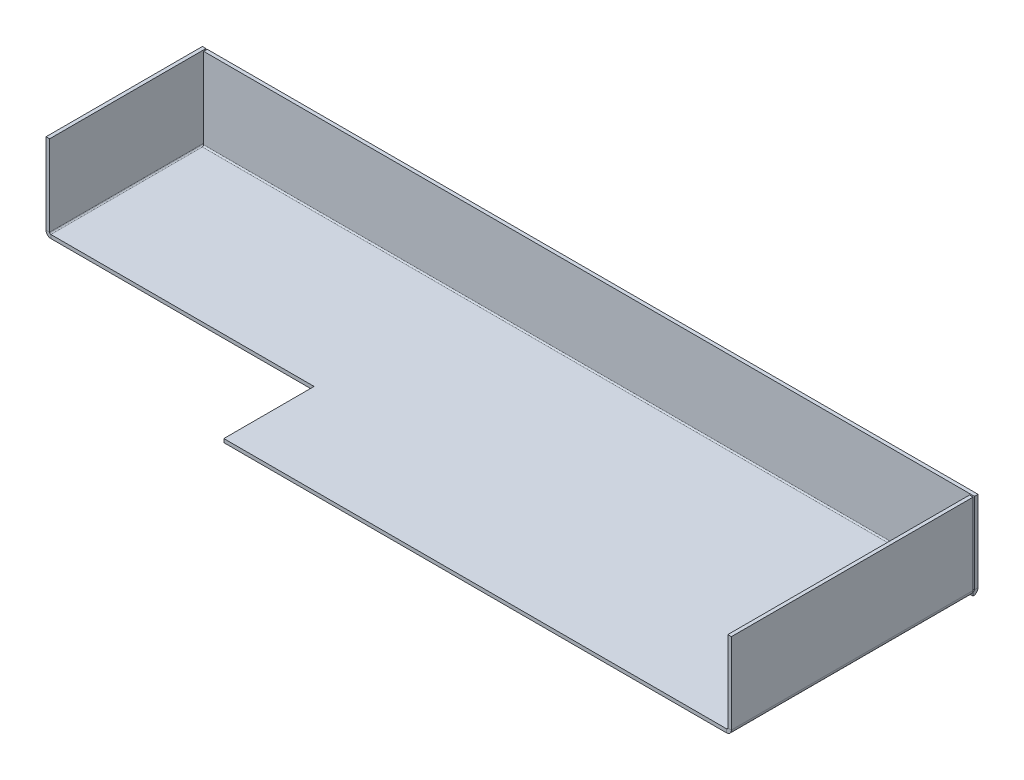
ISO-10303-21;
HEADER;
FILE_DESCRIPTION(('STEP AP214'),'2;1');
FILE_NAME('part.step','',(''),(''),'','','');
FILE_SCHEMA(('AUTOMOTIVE_DESIGN { 1 0 10303 214 1 1 1 1 }'));
ENDSEC;
DATA;
#1=APPLICATION_CONTEXT('core data for automotive mechanical design processes');
#2=APPLICATION_PROTOCOL_DEFINITION('international standard','automotive_design',2000,#1);
#3=PRODUCT_CONTEXT('',#1,'mechanical');
#4=PRODUCT('Part','Part','',(#3));
#5=PRODUCT_RELATED_PRODUCT_CATEGORY('part','',(#4));
#6=PRODUCT_DEFINITION_FORMATION('','',#4);
#7=PRODUCT_DEFINITION_CONTEXT('part definition',#1,'design');
#8=PRODUCT_DEFINITION('design','',#6,#7);
#9=PRODUCT_DEFINITION_SHAPE('','',#8);
#10=(LENGTH_UNIT() NAMED_UNIT(*) SI_UNIT(.MILLI.,.METRE.));
#11=(NAMED_UNIT(*) PLANE_ANGLE_UNIT() SI_UNIT($,.RADIAN.));
#12=(NAMED_UNIT(*) SI_UNIT($,.STERADIAN.) SOLID_ANGLE_UNIT());
#13=UNCERTAINTY_MEASURE_WITH_UNIT(LENGTH_MEASURE(1.E-05),#10,'distance_accuracy_value','');
#14=(GEOMETRIC_REPRESENTATION_CONTEXT(3) GLOBAL_UNCERTAINTY_ASSIGNED_CONTEXT((#13)) GLOBAL_UNIT_ASSIGNED_CONTEXT((#10,
#11,#12)) REPRESENTATION_CONTEXT('',''));
#15=CARTESIAN_POINT('',(0.,0.,0.));
#16=DIRECTION('',(0.,0.,1.));
#17=DIRECTION('',(1.,0.,0.));
#18=AXIS2_PLACEMENT_3D('',#15,#16,#17);
#19=CARTESIAN_POINT('',(217.,0.,-66.2634));
#20=DIRECTION('',(0.,0.,1.));
#21=DIRECTION('',(0.,-1.,0.));
#22=AXIS2_PLACEMENT_3D('',#19,#20,#21);
#23=PLANE('',#22);
#24=DIRECTION('',(-1.,0.,0.));
#25=VECTOR('',#24,1.);
#26=CARTESIAN_POINT('',(217.,0.,-66.2634));
#27=LINE('',#26,#25);
#28=CARTESIAN_POINT('',(217.,0.,-66.2634));
#29=VERTEX_POINT('',#28);
#30=CARTESIAN_POINT('',(216.899002397935,0.,-66.2634));
#31=VERTEX_POINT('',#30);
#32=EDGE_CURVE('E306',#29,#31,#27,.T.);
#33=ORIENTED_EDGE('',*,*,#32,.T.);
#34=CARTESIAN_POINT('',(214.2634,0.736600000000032,-66.2634));
#35=DIRECTION('',(0.,0.,-1.));
#36=DIRECTION('',(0.,1.,0.));
#37=AXIS2_PLACEMENT_3D('',#34,#35,#36);
#38=CIRCLE('',#37,2.7366);
#39=CARTESIAN_POINT('',(214.2634,-2.,-66.2634));
#40=VERTEX_POINT('',#39);
#41=EDGE_CURVE('E13',#31,#40,#38,.T.);
#42=ORIENTED_EDGE('',*,*,#41,.T.);
#43=DIRECTION('',(-1.,0.,0.));
#44=VECTOR('',#43,1.);
#45=CARTESIAN_POINT('',(-214.2634,-2.00000000000003,-66.2634));
#46=LINE('',#45,#44);
#47=CARTESIAN_POINT('',(217.,-2.,-66.2634));
#48=VERTEX_POINT('',#47);
#49=EDGE_CURVE('E308',#48,#40,#46,.T.);
#50=ORIENTED_EDGE('',*,*,#49,.F.);
#51=DIRECTION('',(0.,-1.,0.));
#52=VECTOR('',#51,1.);
#53=CARTESIAN_POINT('',(217.,0.,-66.2634));
#54=LINE('',#53,#52);
#55=EDGE_CURVE('E349',#29,#48,#54,.T.);
#56=ORIENTED_EDGE('',*,*,#55,.F.);
#57=EDGE_LOOP('',(#33,#42,#50,#56));
#58=FACE_BOUND('',#57,.T.);
#59=ADVANCED_FACE('F100',(#58),#23,.T.);
#60=CARTESIAN_POINT('',(0.,-2.,0.));
#61=DIRECTION('',(0.,1.,0.));
#62=DIRECTION('',(0.,0.,1.));
#63=AXIS2_PLACEMENT_3D('',#60,#61,#62);
#64=PLANE('',#63);
#65=DIRECTION('',(0.,0.,-1.));
#66=VECTOR('',#65,1.);
#67=CARTESIAN_POINT('',(214.2634,-1.99999999999997,-66.2634));
#68=LINE('',#67,#66);
#69=CARTESIAN_POINT('',(214.2634,-2.,68.9999999999999));
#70=VERTEX_POINT('',#69);
#71=EDGE_CURVE('E288',#40,#70,#68,.F.);
#72=ORIENTED_EDGE('',*,*,#71,.T.);
#73=DIRECTION('',(1.,0.,0.));
#74=VECTOR('',#73,1.);
#75=CARTESIAN_POINT('',(-66.9999999999999,-2.,68.9999999999999));
#76=LINE('',#75,#74);
#77=CARTESIAN_POINT('',(-66.9999999999999,-2.,68.9999999999999));
#78=VERTEX_POINT('',#77);
#79=EDGE_CURVE('E423',#78,#70,#76,.T.);
#80=ORIENTED_EDGE('',*,*,#79,.F.);
#81=DIRECTION('',(0.,0.,1.));
#82=VECTOR('',#81,1.);
#83=CARTESIAN_POINT('',(-66.9999999999999,-2.,18.5));
#84=LINE('',#83,#82);
#85=CARTESIAN_POINT('',(-66.9999999999999,-2.,18.5));
#86=VERTEX_POINT('',#85);
#87=EDGE_CURVE('E420',#86,#78,#84,.T.);
#88=ORIENTED_EDGE('',*,*,#87,.F.);
#89=DIRECTION('',(1.,0.,0.));
#90=VECTOR('',#89,1.);
#91=CARTESIAN_POINT('',(-217.,-2.,18.5));
#92=LINE('',#91,#90);
#93=CARTESIAN_POINT('',(-214.2634,-2.,18.5));
#94=VERTEX_POINT('',#93);
#95=EDGE_CURVE('E427',#94,#86,#92,.T.);
#96=ORIENTED_EDGE('',*,*,#95,.F.);
#97=DIRECTION('',(0.,0.,1.));
#98=VECTOR('',#97,1.);
#99=CARTESIAN_POINT('',(-214.2634,-2.,18.5));
#100=LINE('',#99,#98);
#101=CARTESIAN_POINT('',(-214.2634,-2.,-66.2634));
#102=VERTEX_POINT('',#101);
#103=EDGE_CURVE('E397',#94,#102,#100,.F.);
#104=ORIENTED_EDGE('',*,*,#103,.T.);
#105=DIRECTION('',(-1.,0.,0.));
#106=VECTOR('',#105,1.);
#107=CARTESIAN_POINT('',(-214.2634,-2.00000000000003,-66.2634));
#108=LINE('',#107,#106);
#109=EDGE_CURVE('E342',#102,#40,#108,.F.);
#110=ORIENTED_EDGE('',*,*,#109,.T.);
#111=EDGE_LOOP('',(#72,#80,#88,#96,#104,#110));
#112=FACE_BOUND('',#111,.T.);
#113=ADVANCED_FACE('F489',(#112),#64,.F.);
#114=CARTESIAN_POINT('',(0.,0.,0.));
#115=DIRECTION('',(0.,1.,0.));
#116=DIRECTION('',(0.,0.,1.));
#117=AXIS2_PLACEMENT_3D('',#114,#115,#116);
#118=PLANE('',#117);
#119=DIRECTION('',(1.,0.,0.));
#120=VECTOR('',#119,1.);
#121=CARTESIAN_POINT('',(-66.9999999999999,0.,68.9999999999999));
#122=LINE('',#121,#120);
#123=CARTESIAN_POINT('',(-66.9999999999999,0.,68.9999999999999));
#124=VERTEX_POINT('',#123);
#125=CARTESIAN_POINT('',(214.2634,0.,68.9999999999999));
#126=VERTEX_POINT('',#125);
#127=EDGE_CURVE('E431',#124,#126,#122,.T.);
#128=ORIENTED_EDGE('',*,*,#127,.T.);
#129=DIRECTION('',(0.,0.,-1.));
#130=VECTOR('',#129,1.);
#131=CARTESIAN_POINT('',(214.2634,0.,-66.2634));
#132=LINE('',#131,#130);
#133=CARTESIAN_POINT('',(214.2634,0.,-66.2634));
#134=VERTEX_POINT('',#133);
#135=EDGE_CURVE('E298',#134,#126,#132,.F.);
#136=ORIENTED_EDGE('',*,*,#135,.F.);
#137=DIRECTION('',(-1.,0.,0.));
#138=VECTOR('',#137,1.);
#139=CARTESIAN_POINT('',(-214.2634,0.,-66.2634));
#140=LINE('',#139,#138);
#141=CARTESIAN_POINT('',(-214.2634,0.,-66.2634));
#142=VERTEX_POINT('',#141);
#143=EDGE_CURVE('E355',#142,#134,#140,.F.);
#144=ORIENTED_EDGE('',*,*,#143,.F.);
#145=DIRECTION('',(0.,0.,1.));
#146=VECTOR('',#145,1.);
#147=CARTESIAN_POINT('',(-214.2634,0.,18.5));
#148=LINE('',#147,#146);
#149=CARTESIAN_POINT('',(-214.2634,0.,18.5));
#150=VERTEX_POINT('',#149);
#151=EDGE_CURVE('E410',#150,#142,#148,.F.);
#152=ORIENTED_EDGE('',*,*,#151,.F.);
#153=DIRECTION('',(1.,0.,0.));
#154=VECTOR('',#153,1.);
#155=CARTESIAN_POINT('',(-217.,0.,18.5));
#156=LINE('',#155,#154);
#157=CARTESIAN_POINT('',(-66.9999999999999,0.,18.5));
#158=VERTEX_POINT('',#157);
#159=EDGE_CURVE('E424',#150,#158,#156,.T.);
#160=ORIENTED_EDGE('',*,*,#159,.T.);
#161=DIRECTION('',(0.,0.,1.));
#162=VECTOR('',#161,1.);
#163=CARTESIAN_POINT('',(-66.9999999999999,0.,18.5));
#164=LINE('',#163,#162);
#165=EDGE_CURVE('E417',#158,#124,#164,.T.);
#166=ORIENTED_EDGE('',*,*,#165,.T.);
#167=EDGE_LOOP('',(#128,#136,#144,#152,#160,#166));
#168=FACE_BOUND('',#167,.T.);
#169=ADVANCED_FACE('F448',(#168),#118,.T.);
#170=CARTESIAN_POINT('',(-214.2634,0.,-69.));
#171=DIRECTION('',(1.,0.,0.));
#172=DIRECTION('',(0.,0.,-1.));
#173=AXIS2_PLACEMENT_3D('',#170,#171,#172);
#174=PLANE('',#173);
#175=DIRECTION('',(0.,0.,1.));
#176=VECTOR('',#175,1.);
#177=CARTESIAN_POINT('',(-214.2634,0.,-69.));
#178=LINE('',#177,#176);
#179=CARTESIAN_POINT('',(-214.2634,0.,-69.));
#180=VERTEX_POINT('',#179);
#181=CARTESIAN_POINT('',(-214.2634,0.,-68.8990023979349));
#182=VERTEX_POINT('',#181);
#183=EDGE_CURVE('E361',#180,#182,#178,.T.);
#184=ORIENTED_EDGE('',*,*,#183,.T.);
#185=CARTESIAN_POINT('',(-214.2634,0.736599999999976,-66.2634));
#186=DIRECTION('',(-1.,0.,0.));
#187=DIRECTION('',(0.,-1.,0.));
#188=AXIS2_PLACEMENT_3D('',#185,#186,#187);
#189=CIRCLE('',#188,2.7366);
#190=EDGE_CURVE('E109',#182,#102,#189,.T.);
#191=ORIENTED_EDGE('',*,*,#190,.T.);
#192=DIRECTION('',(0.,0.,1.));
#193=VECTOR('',#192,1.);
#194=CARTESIAN_POINT('',(-214.2634,-2.,18.5));
#195=LINE('',#194,#193);
#196=CARTESIAN_POINT('',(-214.2634,-2.,-69.));
#197=VERTEX_POINT('',#196);
#198=EDGE_CURVE('E363',#197,#102,#195,.T.);
#199=ORIENTED_EDGE('',*,*,#198,.F.);
#200=DIRECTION('',(0.,-1.,0.));
#201=VECTOR('',#200,1.);
#202=CARTESIAN_POINT('',(-214.2634,0.,-69.));
#203=LINE('',#202,#201);
#204=EDGE_CURVE('E414',#180,#197,#203,.T.);
#205=ORIENTED_EDGE('',*,*,#204,.F.);
#206=EDGE_LOOP('',(#184,#191,#199,#205));
#207=FACE_BOUND('',#206,.T.);
#208=ADVANCED_FACE('F485',(#207),#174,.T.);
#209=CARTESIAN_POINT('',(-217.,-2.,18.5));
#210=DIRECTION('',(0.,0.,1.));
#211=DIRECTION('',(1.,0.,0.));
#212=AXIS2_PLACEMENT_3D('',#209,#210,#211);
#213=PLANE('',#212);
#214=ORIENTED_EDGE('',*,*,#159,.F.);
#215=DIRECTION('',(0.,-1.,0.));
#216=VECTOR('',#215,1.);
#217=CARTESIAN_POINT('',(-214.2634,0.,18.5));
#218=LINE('',#217,#216);
#219=EDGE_CURVE('E404',#150,#94,#218,.T.);
#220=ORIENTED_EDGE('',*,*,#219,.T.);
#221=ORIENTED_EDGE('',*,*,#95,.T.);
#222=DIRECTION('',(0.,1.,0.));
#223=VECTOR('',#222,1.);
#224=CARTESIAN_POINT('',(-66.9999999999999,-2.,18.5));
#225=LINE('',#224,#223);
#226=EDGE_CURVE('E434',#86,#158,#225,.T.);
#227=ORIENTED_EDGE('',*,*,#226,.T.);
#228=EDGE_LOOP('',(#214,#220,#221,#227));
#229=FACE_BOUND('',#228,.T.);
#230=ADVANCED_FACE('F451',(#229),#213,.T.);
#231=CARTESIAN_POINT('',(-66.9999999999999,-2.,18.5));
#232=DIRECTION('',(-1.,0.,0.));
#233=DIRECTION('',(0.,0.,1.));
#234=AXIS2_PLACEMENT_3D('',#231,#232,#233);
#235=PLANE('',#234);
#236=ORIENTED_EDGE('',*,*,#165,.F.);
#237=ORIENTED_EDGE('',*,*,#226,.F.);
#238=ORIENTED_EDGE('',*,*,#87,.T.);
#239=DIRECTION('',(0.,1.,0.));
#240=VECTOR('',#239,1.);
#241=CARTESIAN_POINT('',(-66.9999999999999,-2.,68.9999999999999));
#242=LINE('',#241,#240);
#243=EDGE_CURVE('E104',#78,#124,#242,.T.);
#244=ORIENTED_EDGE('',*,*,#243,.T.);
#245=EDGE_LOOP('',(#236,#237,#238,#244));
#246=FACE_BOUND('',#245,.T.);
#247=ADVANCED_FACE('F102',(#246),#235,.T.);
#248=CARTESIAN_POINT('',(-66.9999999999999,-2.,68.9999999999999));
#249=DIRECTION('',(0.,0.,1.));
#250=DIRECTION('',(1.,0.,0.));
#251=AXIS2_PLACEMENT_3D('',#248,#249,#250);
#252=PLANE('',#251);
#253=DIRECTION('',(0.,-1.,0.));
#254=VECTOR('',#253,1.);
#255=CARTESIAN_POINT('',(214.2634,0.,68.9999999999999));
#256=LINE('',#255,#254);
#257=EDGE_CURVE('E292',#126,#70,#256,.T.);
#258=ORIENTED_EDGE('',*,*,#257,.F.);
#259=ORIENTED_EDGE('',*,*,#127,.F.);
#260=ORIENTED_EDGE('',*,*,#243,.F.);
#261=ORIENTED_EDGE('',*,*,#79,.T.);
#262=EDGE_LOOP('',(#258,#259,#260,#261));
#263=FACE_BOUND('',#262,.T.);
#264=ADVANCED_FACE('F445',(#263),#252,.T.);
#265=CARTESIAN_POINT('',(-214.2634,0.736600000000004,-69.));
#266=DIRECTION('',(0.,0.,-1.));
#267=DIRECTION('',(-1.,0.,0.));
#268=AXIS2_PLACEMENT_3D('',#265,#266,#267);
#269=PLANE('',#268);
#270=DIRECTION('',(1.,0.,0.));
#271=VECTOR('',#270,1.);
#272=CARTESIAN_POINT('',(-217.,0.736600000000004,-69.));
#273=LINE('',#272,#271);
#274=CARTESIAN_POINT('',(-215.,0.736600000000004,-69.));
#275=VERTEX_POINT('',#274);
#276=CARTESIAN_POINT('',(-217.,0.736600000000004,-69.));
#277=VERTEX_POINT('',#276);
#278=EDGE_CURVE('E366',#275,#277,#273,.F.);
#279=ORIENTED_EDGE('',*,*,#278,.F.);
#280=CARTESIAN_POINT('',(-214.2634,0.736600000000004,-69.));
#281=DIRECTION('',(0.,0.,1.));
#282=DIRECTION('',(1.,0.,0.));
#283=AXIS2_PLACEMENT_3D('',#280,#281,#282);
#284=CIRCLE('',#283,0.736600000000004);
#285=EDGE_CURVE('E407',#180,#275,#284,.F.);
#286=ORIENTED_EDGE('',*,*,#285,.F.);
#287=ORIENTED_EDGE('',*,*,#204,.T.);
#288=CARTESIAN_POINT('',(-214.2634,0.736600000000004,-69.));
#289=DIRECTION('',(0.,0.,1.));
#290=DIRECTION('',(1.,0.,0.));
#291=AXIS2_PLACEMENT_3D('',#288,#289,#290);
#292=CIRCLE('',#291,2.7366);
#293=EDGE_CURVE('E400',#197,#277,#292,.F.);
#294=ORIENTED_EDGE('',*,*,#293,.T.);
#295=EDGE_LOOP('',(#279,#286,#287,#294));
#296=FACE_BOUND('',#295,.T.);
#297=ADVANCED_FACE('F483',(#296),#269,.T.);
#298=CARTESIAN_POINT('',(-214.2634,0.736600000000004,18.5));
#299=DIRECTION('',(0.,0.,-1.));
#300=DIRECTION('',(-1.,0.,0.));
#301=AXIS2_PLACEMENT_3D('',#298,#299,#300);
#302=PLANE('',#301);
#303=CARTESIAN_POINT('',(-214.2634,0.736600000000004,18.5));
#304=DIRECTION('',(0.,0.,1.));
#305=DIRECTION('',(1.,0.,0.));
#306=AXIS2_PLACEMENT_3D('',#303,#304,#305);
#307=CIRCLE('',#306,0.736600000000004);
#308=CARTESIAN_POINT('',(-215.,0.736600000000004,18.5));
#309=VERTEX_POINT('',#308);
#310=EDGE_CURVE('E370',#309,#150,#307,.T.);
#311=ORIENTED_EDGE('',*,*,#310,.F.);
#312=DIRECTION('',(1.,0.,0.));
#313=VECTOR('',#312,1.);
#314=CARTESIAN_POINT('',(-215.,0.736600000000004,18.5));
#315=LINE('',#314,#313);
#316=CARTESIAN_POINT('',(-217.,0.736600000000004,18.5));
#317=VERTEX_POINT('',#316);
#318=EDGE_CURVE('E390',#309,#317,#315,.F.);
#319=ORIENTED_EDGE('',*,*,#318,.T.);
#320=CARTESIAN_POINT('',(-214.2634,0.736600000000004,18.5));
#321=DIRECTION('',(0.,0.,1.));
#322=DIRECTION('',(1.,0.,0.));
#323=AXIS2_PLACEMENT_3D('',#320,#321,#322);
#324=CIRCLE('',#323,2.7366);
#325=EDGE_CURVE('E401',#317,#94,#324,.T.);
#326=ORIENTED_EDGE('',*,*,#325,.T.);
#327=ORIENTED_EDGE('',*,*,#219,.F.);
#328=EDGE_LOOP('',(#311,#319,#326,#327));
#329=FACE_BOUND('',#328,.T.);
#330=ADVANCED_FACE('F455',(#329),#302,.F.);
#331=CARTESIAN_POINT('',(-214.2634,0.736600000000004,18.5));
#332=DIRECTION('',(0.,0.,1.));
#333=DIRECTION('',(-1.,0.,0.));
#334=AXIS2_PLACEMENT_3D('',#331,#332,#333);
#335=CYLINDRICAL_SURFACE('',#334,2.7366);
#336=ORIENTED_EDGE('',*,*,#103,.F.);
#337=ORIENTED_EDGE('',*,*,#325,.F.);
#338=DIRECTION('',(0.,0.,1.));
#339=VECTOR('',#338,1.);
#340=CARTESIAN_POINT('',(-217.,0.736600000000004,-69.));
#341=LINE('',#340,#339);
#342=EDGE_CURVE('E388',#317,#277,#341,.F.);
#343=ORIENTED_EDGE('',*,*,#342,.T.);
#344=ORIENTED_EDGE('',*,*,#293,.F.);
#345=ORIENTED_EDGE('',*,*,#198,.T.);
#346=EDGE_LOOP('',(#336,#337,#343,#344,#345));
#347=FACE_BOUND('',#346,.T.);
#348=ADVANCED_FACE('F481',(#347),#335,.T.);
#349=CARTESIAN_POINT('',(-214.2634,0.736600000000004,18.5));
#350=DIRECTION('',(0.,0.,1.));
#351=DIRECTION('',(-1.,0.,0.));
#352=AXIS2_PLACEMENT_3D('',#349,#350,#351);
#353=CYLINDRICAL_SURFACE('',#352,0.736600000000004);
#354=ORIENTED_EDGE('',*,*,#151,.T.);
#355=EDGE_CURVE('E126',#182,#142,#178,.T.);
#356=ORIENTED_EDGE('',*,*,#355,.F.);
#357=ORIENTED_EDGE('',*,*,#183,.F.);
#358=ORIENTED_EDGE('',*,*,#285,.T.);
#359=DIRECTION('',(0.,0.,1.));
#360=VECTOR('',#359,1.);
#361=CARTESIAN_POINT('',(-215.,0.736600000000004,-69.));
#362=LINE('',#361,#360);
#363=EDGE_CURVE('E393',#275,#309,#362,.T.);
#364=ORIENTED_EDGE('',*,*,#363,.T.);
#365=ORIENTED_EDGE('',*,*,#310,.T.);
#366=EDGE_LOOP('',(#354,#356,#357,#358,#364,#365));
#367=FACE_BOUND('',#366,.T.);
#368=ADVANCED_FACE('F457',(#367),#353,.F.);
#369=CARTESIAN_POINT('',(-217.,0.,-69.));
#370=DIRECTION('',(0.,0.,1.));
#371=DIRECTION('',(1.,0.,0.));
#372=AXIS2_PLACEMENT_3D('',#369,#370,#371);
#373=PLANE('',#372);
#374=ORIENTED_EDGE('',*,*,#278,.T.);
#375=DIRECTION('',(0.,-1.,0.));
#376=VECTOR('',#375,1.);
#377=CARTESIAN_POINT('',(-217.,-8.04911692853238E-13,-69.));
#378=LINE('',#377,#376);
#379=CARTESIAN_POINT('',(-217.,46.,-69.));
#380=VERTEX_POINT('',#379);
#381=EDGE_CURVE('E378',#380,#277,#378,.T.);
#382=ORIENTED_EDGE('',*,*,#381,.F.);
#383=DIRECTION('',(1.,0.,0.));
#384=VECTOR('',#383,1.);
#385=CARTESIAN_POINT('',(-217.,46.,-69.));
#386=LINE('',#385,#384);
#387=CARTESIAN_POINT('',(-215.,46.,-69.));
#388=VERTEX_POINT('',#387);
#389=EDGE_CURVE('E371',#380,#388,#386,.T.);
#390=ORIENTED_EDGE('',*,*,#389,.T.);
#391=DIRECTION('',(0.,1.,0.));
#392=VECTOR('',#391,1.);
#393=CARTESIAN_POINT('',(-215.,0.,-69.));
#394=LINE('',#393,#392);
#395=EDGE_CURVE('E385',#388,#275,#394,.F.);
#396=ORIENTED_EDGE('',*,*,#395,.T.);
#397=EDGE_LOOP('',(#374,#382,#390,#396));
#398=FACE_BOUND('',#397,.T.);
#399=ADVANCED_FACE('F466',(#398),#373,.F.);
#400=CARTESIAN_POINT('',(-217.,46.,18.5));
#401=DIRECTION('',(0.,0.,-1.));
#402=DIRECTION('',(-1.,0.,0.));
#403=AXIS2_PLACEMENT_3D('',#400,#401,#402);
#404=PLANE('',#403);
#405=ORIENTED_EDGE('',*,*,#318,.F.);
#406=DIRECTION('',(0.,-1.,0.));
#407=VECTOR('',#406,1.);
#408=CARTESIAN_POINT('',(-215.,46.,18.5));
#409=LINE('',#408,#407);
#410=CARTESIAN_POINT('',(-215.,46.,18.5));
#411=VERTEX_POINT('',#410);
#412=EDGE_CURVE('E383',#309,#411,#409,.F.);
#413=ORIENTED_EDGE('',*,*,#412,.T.);
#414=DIRECTION('',(1.,0.,0.));
#415=VECTOR('',#414,1.);
#416=CARTESIAN_POINT('',(-217.,46.,18.5));
#417=LINE('',#416,#415);
#418=CARTESIAN_POINT('',(-217.,46.,18.5));
#419=VERTEX_POINT('',#418);
#420=EDGE_CURVE('E367',#419,#411,#417,.T.);
#421=ORIENTED_EDGE('',*,*,#420,.F.);
#422=DIRECTION('',(0.,1.,0.));
#423=VECTOR('',#422,1.);
#424=CARTESIAN_POINT('',(-217.,-8.04911692853238E-13,18.5));
#425=LINE('',#424,#423);
#426=EDGE_CURVE('E376',#317,#419,#425,.T.);
#427=ORIENTED_EDGE('',*,*,#426,.F.);
#428=EDGE_LOOP('',(#405,#413,#421,#427));
#429=FACE_BOUND('',#428,.T.);
#430=ADVANCED_FACE('F475',(#429),#404,.F.);
#431=CARTESIAN_POINT('',(-217.,-8.04911692853238E-13,0.));
#432=DIRECTION('',(1.,0.,0.));
#433=DIRECTION('',(0.,1.,0.));
#434=AXIS2_PLACEMENT_3D('',#431,#432,#433);
#435=PLANE('',#434);
#436=ORIENTED_EDGE('',*,*,#342,.F.);
#437=ORIENTED_EDGE('',*,*,#426,.T.);
#438=DIRECTION('',(0.,0.,-1.));
#439=VECTOR('',#438,1.);
#440=CARTESIAN_POINT('',(-217.,46.,0.));
#441=LINE('',#440,#439);
#442=EDGE_CURVE('E374',#419,#380,#441,.T.);
#443=ORIENTED_EDGE('',*,*,#442,.T.);
#444=ORIENTED_EDGE('',*,*,#381,.T.);
#445=EDGE_LOOP('',(#436,#437,#443,#444));
#446=FACE_BOUND('',#445,.T.);
#447=ADVANCED_FACE('F478',(#446),#435,.F.);
#448=CARTESIAN_POINT('',(-215.,-7.7715611723761E-13,0.));
#449=DIRECTION('',(1.,0.,0.));
#450=DIRECTION('',(0.,1.,0.));
#451=AXIS2_PLACEMENT_3D('',#448,#449,#450);
#452=PLANE('',#451);
#453=ORIENTED_EDGE('',*,*,#412,.F.);
#454=ORIENTED_EDGE('',*,*,#363,.F.);
#455=ORIENTED_EDGE('',*,*,#395,.F.);
#456=DIRECTION('',(0.,0.,1.));
#457=VECTOR('',#456,1.);
#458=CARTESIAN_POINT('',(-215.,46.,-69.));
#459=LINE('',#458,#457);
#460=EDGE_CURVE('E381',#411,#388,#459,.F.);
#461=ORIENTED_EDGE('',*,*,#460,.F.);
#462=EDGE_LOOP('',(#453,#454,#455,#461));
#463=FACE_BOUND('',#462,.T.);
#464=ADVANCED_FACE('F463',(#463),#452,.T.);
#465=CARTESIAN_POINT('',(-217.,46.,-69.));
#466=DIRECTION('',(0.,-1.,0.));
#467=DIRECTION('',(1.,0.,0.));
#468=AXIS2_PLACEMENT_3D('',#465,#466,#467);
#469=PLANE('',#468);
#470=ORIENTED_EDGE('',*,*,#460,.T.);
#471=ORIENTED_EDGE('',*,*,#389,.F.);
#472=ORIENTED_EDGE('',*,*,#442,.F.);
#473=ORIENTED_EDGE('',*,*,#420,.T.);
#474=EDGE_LOOP('',(#470,#471,#472,#473));
#475=FACE_BOUND('',#474,.T.);
#476=ADVANCED_FACE('F471',(#475),#469,.F.);
#477=CARTESIAN_POINT('',(217.,0.736600000000004,-66.2634));
#478=DIRECTION('',(1.,0.,0.));
#479=DIRECTION('',(0.,1.,0.));
#480=AXIS2_PLACEMENT_3D('',#477,#478,#479);
#481=PLANE('',#480);
#482=DIRECTION('',(0.,0.,1.));
#483=VECTOR('',#482,1.);
#484=CARTESIAN_POINT('',(217.,0.736600000000032,-69.));
#485=LINE('',#484,#483);
#486=CARTESIAN_POINT('',(217.,0.736600000000004,-67.));
#487=VERTEX_POINT('',#486);
#488=CARTESIAN_POINT('',(217.,0.736600000000004,-69.));
#489=VERTEX_POINT('',#488);
#490=EDGE_CURVE('E311',#487,#489,#485,.F.);
#491=ORIENTED_EDGE('',*,*,#490,.F.);
#492=CARTESIAN_POINT('',(217.,0.736600000000004,-66.2634));
#493=DIRECTION('',(-1.,0.,0.));
#494=DIRECTION('',(0.,-1.,0.));
#495=AXIS2_PLACEMENT_3D('',#492,#493,#494);
#496=CIRCLE('',#495,0.736600000000004);
#497=EDGE_CURVE('E352',#29,#487,#496,.F.);
#498=ORIENTED_EDGE('',*,*,#497,.F.);
#499=ORIENTED_EDGE('',*,*,#55,.T.);
#500=CARTESIAN_POINT('',(217.,0.736600000000004,-66.2634));
#501=DIRECTION('',(-1.,0.,0.));
#502=DIRECTION('',(0.,-1.,0.));
#503=AXIS2_PLACEMENT_3D('',#500,#501,#502);
#504=CIRCLE('',#503,2.7366);
#505=EDGE_CURVE('E345',#48,#489,#504,.F.);
#506=ORIENTED_EDGE('',*,*,#505,.T.);
#507=EDGE_LOOP('',(#491,#498,#499,#506));
#508=FACE_BOUND('',#507,.T.);
#509=ADVANCED_FACE('F498',(#508),#481,.T.);
#510=CARTESIAN_POINT('',(-214.2634,0.736599999999976,-66.2634));
#511=DIRECTION('',(1.,0.,0.));
#512=DIRECTION('',(0.,1.,0.));
#513=AXIS2_PLACEMENT_3D('',#510,#511,#512);
#514=PLANE('',#513);
#515=CARTESIAN_POINT('',(-214.2634,0.736600000000004,-69.));
#516=VERTEX_POINT('',#515);
#517=EDGE_CURVE('E346',#516,#182,#189,.T.);
#518=ORIENTED_EDGE('',*,*,#517,.T.);
#519=ORIENTED_EDGE('',*,*,#355,.T.);
#520=CARTESIAN_POINT('',(-214.2634,0.736599999999976,-66.2634));
#521=DIRECTION('',(-1.,0.,0.));
#522=DIRECTION('',(0.,-1.,0.));
#523=AXIS2_PLACEMENT_3D('',#520,#521,#522);
#524=CIRCLE('',#523,0.736600000000004);
#525=CARTESIAN_POINT('',(-214.2634,0.736599999999976,-67.));
#526=VERTEX_POINT('',#525);
#527=EDGE_CURVE('E315',#526,#142,#524,.T.);
#528=ORIENTED_EDGE('',*,*,#527,.F.);
#529=DIRECTION('',(0.,0.,1.));
#530=VECTOR('',#529,1.);
#531=CARTESIAN_POINT('',(-214.2634,0.736600000000004,-67.));
#532=LINE('',#531,#530);
#533=EDGE_CURVE('E335',#526,#516,#532,.F.);
#534=ORIENTED_EDGE('',*,*,#533,.T.);
#535=EDGE_LOOP('',(#518,#519,#528,#534));
#536=FACE_BOUND('',#535,.T.);
#537=ADVANCED_FACE('F521',(#536),#514,.F.);
#538=CARTESIAN_POINT('',(-214.2634,0.736599999999976,-66.2634));
#539=DIRECTION('',(-1.,0.,0.));
#540=DIRECTION('',(0.,0.,-1.));
#541=AXIS2_PLACEMENT_3D('',#538,#539,#540);
#542=CYLINDRICAL_SURFACE('',#541,2.7366);
#543=ORIENTED_EDGE('',*,*,#109,.F.);
#544=ORIENTED_EDGE('',*,*,#190,.F.);
#545=ORIENTED_EDGE('',*,*,#517,.F.);
#546=DIRECTION('',(-1.,0.,0.));
#547=VECTOR('',#546,1.);
#548=CARTESIAN_POINT('',(217.,0.736600000000032,-69.));
#549=LINE('',#548,#547);
#550=EDGE_CURVE('E333',#516,#489,#549,.F.);
#551=ORIENTED_EDGE('',*,*,#550,.T.);
#552=ORIENTED_EDGE('',*,*,#505,.F.);
#553=ORIENTED_EDGE('',*,*,#49,.T.);
#554=EDGE_LOOP('',(#543,#544,#545,#551,#552,#553));
#555=FACE_BOUND('',#554,.T.);
#556=ADVANCED_FACE('F492',(#555),#542,.T.);
#557=CARTESIAN_POINT('',(-214.2634,0.736599999999976,-66.2634));
#558=DIRECTION('',(-1.,0.,0.));
#559=DIRECTION('',(0.,0.,-1.));
#560=AXIS2_PLACEMENT_3D('',#557,#558,#559);
#561=CYLINDRICAL_SURFACE('',#560,0.736600000000004);
#562=ORIENTED_EDGE('',*,*,#143,.T.);
#563=EDGE_CURVE('E118',#31,#134,#27,.T.);
#564=ORIENTED_EDGE('',*,*,#563,.F.);
#565=ORIENTED_EDGE('',*,*,#32,.F.);
#566=ORIENTED_EDGE('',*,*,#497,.T.);
#567=DIRECTION('',(-1.,0.,0.));
#568=VECTOR('',#567,1.);
#569=CARTESIAN_POINT('',(217.,0.736600000000004,-67.));
#570=LINE('',#569,#568);
#571=EDGE_CURVE('E338',#487,#526,#570,.T.);
#572=ORIENTED_EDGE('',*,*,#571,.T.);
#573=ORIENTED_EDGE('',*,*,#527,.T.);
#574=EDGE_LOOP('',(#562,#564,#565,#566,#572,#573));
#575=FACE_BOUND('',#574,.T.);
#576=ADVANCED_FACE('F500',(#575),#561,.F.);
#577=CARTESIAN_POINT('',(217.,0.,-69.));
#578=DIRECTION('',(-1.,0.,0.));
#579=DIRECTION('',(0.,0.,1.));
#580=AXIS2_PLACEMENT_3D('',#577,#578,#579);
#581=PLANE('',#580);
#582=ORIENTED_EDGE('',*,*,#490,.T.);
#583=DIRECTION('',(0.,-1.,0.));
#584=VECTOR('',#583,1.);
#585=CARTESIAN_POINT('',(217.,-2.4980018054066E-13,-69.));
#586=LINE('',#585,#584);
#587=CARTESIAN_POINT('',(217.,46.,-69.0000000000002));
#588=VERTEX_POINT('',#587);
#589=EDGE_CURVE('E323',#588,#489,#586,.T.);
#590=ORIENTED_EDGE('',*,*,#589,.F.);
#591=DIRECTION('',(0.,0.,1.));
#592=VECTOR('',#591,1.);
#593=CARTESIAN_POINT('',(217.,46.,-69.0000000000002));
#594=LINE('',#593,#592);
#595=CARTESIAN_POINT('',(217.,46.,-67.0000000000002));
#596=VERTEX_POINT('',#595);
#597=EDGE_CURVE('E316',#588,#596,#594,.T.);
#598=ORIENTED_EDGE('',*,*,#597,.T.);
#599=DIRECTION('',(0.,1.,0.));
#600=VECTOR('',#599,1.);
#601=CARTESIAN_POINT('',(217.,0.,-67.));
#602=LINE('',#601,#600);
#603=EDGE_CURVE('E330',#596,#487,#602,.F.);
#604=ORIENTED_EDGE('',*,*,#603,.T.);
#605=EDGE_LOOP('',(#582,#590,#598,#604));
#606=FACE_BOUND('',#605,.T.);
#607=ADVANCED_FACE('F508',(#606),#581,.F.);
#608=CARTESIAN_POINT('',(-214.2634,46.,-69.0000000000002));
#609=DIRECTION('',(1.,0.,0.));
#610=DIRECTION('',(0.,0.,-1.));
#611=AXIS2_PLACEMENT_3D('',#608,#609,#610);
#612=PLANE('',#611);
#613=ORIENTED_EDGE('',*,*,#533,.F.);
#614=DIRECTION('',(0.,-1.,0.));
#615=VECTOR('',#614,1.);
#616=CARTESIAN_POINT('',(-214.2634,46.,-67.0000000000002));
#617=LINE('',#616,#615);
#618=CARTESIAN_POINT('',(-214.2634,46.,-67.0000000000002));
#619=VERTEX_POINT('',#618);
#620=EDGE_CURVE('E328',#526,#619,#617,.F.);
#621=ORIENTED_EDGE('',*,*,#620,.T.);
#622=DIRECTION('',(0.,0.,1.));
#623=VECTOR('',#622,1.);
#624=CARTESIAN_POINT('',(-214.2634,46.,-69.0000000000002));
#625=LINE('',#624,#623);
#626=CARTESIAN_POINT('',(-214.2634,46.,-69.0000000000002));
#627=VERTEX_POINT('',#626);
#628=EDGE_CURVE('E312',#627,#619,#625,.T.);
#629=ORIENTED_EDGE('',*,*,#628,.F.);
#630=DIRECTION('',(0.,1.,0.));
#631=VECTOR('',#630,1.);
#632=CARTESIAN_POINT('',(-214.2634,-2.4980018054066E-13,-69.));
#633=LINE('',#632,#631);
#634=EDGE_CURVE('E321',#516,#627,#633,.T.);
#635=ORIENTED_EDGE('',*,*,#634,.F.);
#636=EDGE_LOOP('',(#613,#621,#629,#635));
#637=FACE_BOUND('',#636,.T.);
#638=ADVANCED_FACE('F518',(#637),#612,.F.);
#639=CARTESIAN_POINT('',(0.,-2.4980018054066E-13,-69.));
#640=DIRECTION('',(0.,0.,1.));
#641=DIRECTION('',(0.,-1.,0.));
#642=AXIS2_PLACEMENT_3D('',#639,#640,#641);
#643=PLANE('',#642);
#644=ORIENTED_EDGE('',*,*,#550,.F.);
#645=ORIENTED_EDGE('',*,*,#634,.T.);
#646=DIRECTION('',(1.,0.,0.));
#647=VECTOR('',#646,1.);
#648=CARTESIAN_POINT('',(0.,46.,-69.0000000000002));
#649=LINE('',#648,#647);
#650=EDGE_CURVE('E319',#627,#588,#649,.T.);
#651=ORIENTED_EDGE('',*,*,#650,.T.);
#652=ORIENTED_EDGE('',*,*,#589,.T.);
#653=EDGE_LOOP('',(#644,#645,#651,#652));
#654=FACE_BOUND('',#653,.T.);
#655=ADVANCED_FACE('F523',(#654),#643,.F.);
#656=CARTESIAN_POINT('',(0.,-2.4980018054066E-13,-67.));
#657=DIRECTION('',(0.,0.,1.));
#658=DIRECTION('',(0.,-1.,0.));
#659=AXIS2_PLACEMENT_3D('',#656,#657,#658);
#660=PLANE('',#659);
#661=ORIENTED_EDGE('',*,*,#620,.F.);
#662=ORIENTED_EDGE('',*,*,#571,.F.);
#663=ORIENTED_EDGE('',*,*,#603,.F.);
#664=DIRECTION('',(-1.,0.,0.));
#665=VECTOR('',#664,1.);
#666=CARTESIAN_POINT('',(217.,46.,-67.0000000000002));
#667=LINE('',#666,#665);
#668=EDGE_CURVE('E326',#619,#596,#667,.F.);
#669=ORIENTED_EDGE('',*,*,#668,.F.);
#670=EDGE_LOOP('',(#661,#662,#663,#669));
#671=FACE_BOUND('',#670,.T.);
#672=ADVANCED_FACE('F505',(#671),#660,.T.);
#673=CARTESIAN_POINT('',(217.,46.,-69.0000000000002));
#674=DIRECTION('',(0.,-1.,0.));
#675=DIRECTION('',(0.,0.,-1.));
#676=AXIS2_PLACEMENT_3D('',#673,#674,#675);
#677=PLANE('',#676);
#678=ORIENTED_EDGE('',*,*,#668,.T.);
#679=ORIENTED_EDGE('',*,*,#597,.F.);
#680=ORIENTED_EDGE('',*,*,#650,.F.);
#681=ORIENTED_EDGE('',*,*,#628,.T.);
#682=EDGE_LOOP('',(#678,#679,#680,#681));
#683=FACE_BOUND('',#682,.T.);
#684=ADVANCED_FACE('F513',(#683),#677,.F.);
#685=CARTESIAN_POINT('',(214.2634,0.736600000000004,68.9999999999999));
#686=DIRECTION('',(0.,0.,1.));
#687=DIRECTION('',(0.,-1.,0.));
#688=AXIS2_PLACEMENT_3D('',#685,#686,#687);
#689=PLANE('',#688);
#690=DIRECTION('',(-1.,0.,0.));
#691=VECTOR('',#690,1.);
#692=CARTESIAN_POINT('',(217.,0.736600000000004,68.9999999999999));
#693=LINE('',#692,#691);
#694=CARTESIAN_POINT('',(215.,0.736600000000004,68.9999999999999));
#695=VERTEX_POINT('',#694);
#696=CARTESIAN_POINT('',(217.,0.736600000000004,68.9999999999999));
#697=VERTEX_POINT('',#696);
#698=EDGE_CURVE('E271',#695,#697,#693,.F.);
#699=ORIENTED_EDGE('',*,*,#698,.F.);
#700=CARTESIAN_POINT('',(214.2634,0.736600000000004,68.9999999999999));
#701=DIRECTION('',(0.,0.,-1.));
#702=DIRECTION('',(0.,1.,0.));
#703=AXIS2_PLACEMENT_3D('',#700,#701,#702);
#704=CIRCLE('',#703,0.736600000000004);
#705=EDGE_CURVE('E295',#126,#695,#704,.F.);
#706=ORIENTED_EDGE('',*,*,#705,.F.);
#707=ORIENTED_EDGE('',*,*,#257,.T.);
#708=CARTESIAN_POINT('',(214.2634,0.736600000000004,68.9999999999999));
#709=DIRECTION('',(0.,0.,-1.));
#710=DIRECTION('',(0.,1.,0.));
#711=AXIS2_PLACEMENT_3D('',#708,#709,#710);
#712=CIRCLE('',#711,2.7366);
#713=EDGE_CURVE('E290',#70,#697,#712,.F.);
#714=ORIENTED_EDGE('',*,*,#713,.T.);
#715=EDGE_LOOP('',(#699,#706,#707,#714));
#716=FACE_BOUND('',#715,.T.);
#717=ADVANCED_FACE('F543',(#716),#689,.T.);
#718=CARTESIAN_POINT('',(214.2634,0.736600000000032,-66.2634));
#719=DIRECTION('',(0.,0.,1.));
#720=DIRECTION('',(0.,-1.,0.));
#721=AXIS2_PLACEMENT_3D('',#718,#719,#720);
#722=PLANE('',#721);
#723=CARTESIAN_POINT('',(217.,0.736600000000032,-66.2634));
#724=VERTEX_POINT('',#723);
#725=EDGE_CURVE('E111',#724,#31,#38,.T.);
#726=ORIENTED_EDGE('',*,*,#725,.T.);
#727=ORIENTED_EDGE('',*,*,#563,.T.);
#728=CARTESIAN_POINT('',(214.2634,0.736600000000032,-66.2634));
#729=DIRECTION('',(0.,0.,-1.));
#730=DIRECTION('',(0.,1.,0.));
#731=AXIS2_PLACEMENT_3D('',#728,#729,#730);
#732=CIRCLE('',#731,0.736600000000004);
#733=CARTESIAN_POINT('',(215.,0.736600000000032,-66.2634));
#734=VERTEX_POINT('',#733);
#735=EDGE_CURVE('E301',#734,#134,#732,.T.);
#736=ORIENTED_EDGE('',*,*,#735,.F.);
#737=DIRECTION('',(-1.,0.,0.));
#738=VECTOR('',#737,1.);
#739=CARTESIAN_POINT('',(215.,0.736600000000032,-66.2634));
#740=LINE('',#739,#738);
#741=EDGE_CURVE('E282',#734,#724,#740,.F.);
#742=ORIENTED_EDGE('',*,*,#741,.T.);
#743=EDGE_LOOP('',(#726,#727,#736,#742));
#744=FACE_BOUND('',#743,.T.);
#745=ADVANCED_FACE('F539',(#744),#722,.F.);
#746=CARTESIAN_POINT('',(214.2634,0.736600000000032,-66.2634));
#747=DIRECTION('',(0.,0.,-1.));
#748=DIRECTION('',(1.,0.,0.));
#749=AXIS2_PLACEMENT_3D('',#746,#747,#748);
#750=CYLINDRICAL_SURFACE('',#749,2.7366);
#751=ORIENTED_EDGE('',*,*,#71,.F.);
#752=ORIENTED_EDGE('',*,*,#41,.F.);
#753=ORIENTED_EDGE('',*,*,#725,.F.);
#754=DIRECTION('',(0.,0.,-1.));
#755=VECTOR('',#754,1.);
#756=CARTESIAN_POINT('',(217.,0.736600000000004,68.9999999999999));
#757=LINE('',#756,#755);
#758=EDGE_CURVE('E280',#724,#697,#757,.F.);
#759=ORIENTED_EDGE('',*,*,#758,.T.);
#760=ORIENTED_EDGE('',*,*,#713,.F.);
#761=EDGE_LOOP('',(#751,#752,#753,#759,#760));
#762=FACE_BOUND('',#761,.T.);
#763=ADVANCED_FACE('F542',(#762),#750,.T.);
#764=CARTESIAN_POINT('',(214.2634,0.736600000000032,-66.2634));
#765=DIRECTION('',(0.,0.,-1.));
#766=DIRECTION('',(1.,0.,0.));
#767=AXIS2_PLACEMENT_3D('',#764,#765,#766);
#768=CYLINDRICAL_SURFACE('',#767,0.736600000000004);
#769=ORIENTED_EDGE('',*,*,#135,.T.);
#770=ORIENTED_EDGE('',*,*,#705,.T.);
#771=DIRECTION('',(0.,0.,-1.));
#772=VECTOR('',#771,1.);
#773=CARTESIAN_POINT('',(215.,0.736600000000004,68.9999999999999));
#774=LINE('',#773,#772);
#775=EDGE_CURVE('E285',#695,#734,#774,.T.);
#776=ORIENTED_EDGE('',*,*,#775,.T.);
#777=ORIENTED_EDGE('',*,*,#735,.T.);
#778=EDGE_LOOP('',(#769,#770,#776,#777));
#779=FACE_BOUND('',#778,.T.);
#780=ADVANCED_FACE('F548',(#779),#768,.F.);
#781=CARTESIAN_POINT('',(217.,0.,68.9999999999999));
#782=DIRECTION('',(0.,0.,-1.));
#783=DIRECTION('',(-1.,0.,0.));
#784=AXIS2_PLACEMENT_3D('',#781,#782,#783);
#785=PLANE('',#784);
#786=ORIENTED_EDGE('',*,*,#698,.T.);
#787=DIRECTION('',(0.,-1.,0.));
#788=VECTOR('',#787,1.);
#789=CARTESIAN_POINT('',(217.,-6.66133814775094E-13,68.9999999999999));
#790=LINE('',#789,#788);
#791=CARTESIAN_POINT('',(217.,46.,68.9999999999999));
#792=VERTEX_POINT('',#791);
#793=EDGE_CURVE('E252',#792,#697,#790,.T.);
#794=ORIENTED_EDGE('',*,*,#793,.F.);
#795=DIRECTION('',(-1.,0.,0.));
#796=VECTOR('',#795,1.);
#797=CARTESIAN_POINT('',(217.,46.,68.9999999999999));
#798=LINE('',#797,#796);
#799=CARTESIAN_POINT('',(215.,46.,68.9999999999999));
#800=VERTEX_POINT('',#799);
#801=EDGE_CURVE('E258',#792,#800,#798,.T.);
#802=ORIENTED_EDGE('',*,*,#801,.T.);
#803=DIRECTION('',(0.,1.,0.));
#804=VECTOR('',#803,1.);
#805=CARTESIAN_POINT('',(215.,0.,68.9999999999999));
#806=LINE('',#805,#804);
#807=EDGE_CURVE('E278',#800,#695,#806,.F.);
#808=ORIENTED_EDGE('',*,*,#807,.T.);
#809=EDGE_LOOP('',(#786,#794,#802,#808));
#810=FACE_BOUND('',#809,.T.);
#811=ADVANCED_FACE('F270',(#810),#785,.F.);
#812=CARTESIAN_POINT('',(217.,46.,-66.2634));
#813=DIRECTION('',(0.,0.,1.));
#814=DIRECTION('',(1.,0.,0.));
#815=AXIS2_PLACEMENT_3D('',#812,#813,#814);
#816=PLANE('',#815);
#817=ORIENTED_EDGE('',*,*,#741,.F.);
#818=DIRECTION('',(0.,-1.,0.));
#819=VECTOR('',#818,1.);
#820=CARTESIAN_POINT('',(215.,46.,-66.2634));
#821=LINE('',#820,#819);
#822=CARTESIAN_POINT('',(215.,46.,-66.2634));
#823=VERTEX_POINT('',#822);
#824=EDGE_CURVE('E274',#734,#823,#821,.F.);
#825=ORIENTED_EDGE('',*,*,#824,.T.);
#826=DIRECTION('',(-1.,0.,0.));
#827=VECTOR('',#826,1.);
#828=CARTESIAN_POINT('',(217.,46.,-66.2634));
#829=LINE('',#828,#827);
#830=CARTESIAN_POINT('',(217.,46.,-66.2634));
#831=VERTEX_POINT('',#830);
#832=EDGE_CURVE('E267',#831,#823,#829,.T.);
#833=ORIENTED_EDGE('',*,*,#832,.F.);
#834=DIRECTION('',(0.,1.,0.));
#835=VECTOR('',#834,1.);
#836=CARTESIAN_POINT('',(217.,-6.66133814775094E-13,-66.2634));
#837=LINE('',#836,#835);
#838=EDGE_CURVE('E254',#724,#831,#837,.T.);
#839=ORIENTED_EDGE('',*,*,#838,.F.);
#840=EDGE_LOOP('',(#817,#825,#833,#839));
#841=FACE_BOUND('',#840,.T.);
#842=ADVANCED_FACE('F557',(#841),#816,.F.);
#843=CARTESIAN_POINT('',(217.,-6.66133814775094E-13,0.));
#844=DIRECTION('',(-1.,0.,0.));
#845=DIRECTION('',(0.,-1.,0.));
#846=AXIS2_PLACEMENT_3D('',#843,#844,#845);
#847=PLANE('',#846);
#848=ORIENTED_EDGE('',*,*,#758,.F.);
#849=ORIENTED_EDGE('',*,*,#838,.T.);
#850=DIRECTION('',(0.,0.,1.));
#851=VECTOR('',#850,1.);
#852=CARTESIAN_POINT('',(217.,46.,0.));
#853=LINE('',#852,#851);
#854=EDGE_CURVE('E247',#831,#792,#853,.T.);
#855=ORIENTED_EDGE('',*,*,#854,.T.);
#856=ORIENTED_EDGE('',*,*,#793,.T.);
#857=EDGE_LOOP('',(#848,#849,#855,#856));
#858=FACE_BOUND('',#857,.T.);
#859=ADVANCED_FACE('F250',(#858),#847,.F.);
#860=CARTESIAN_POINT('',(215.,-6.66133814775094E-13,0.));
#861=DIRECTION('',(-1.,0.,0.));
#862=DIRECTION('',(0.,-1.,0.));
#863=AXIS2_PLACEMENT_3D('',#860,#861,#862);
#864=PLANE('',#863);
#865=ORIENTED_EDGE('',*,*,#824,.F.);
#866=ORIENTED_EDGE('',*,*,#775,.F.);
#867=ORIENTED_EDGE('',*,*,#807,.F.);
#868=DIRECTION('',(0.,0.,-1.));
#869=VECTOR('',#868,1.);
#870=CARTESIAN_POINT('',(215.,46.,68.9999999999999));
#871=LINE('',#870,#869);
#872=EDGE_CURVE('E263',#823,#800,#871,.F.);
#873=ORIENTED_EDGE('',*,*,#872,.F.);
#874=EDGE_LOOP('',(#865,#866,#867,#873));
#875=FACE_BOUND('',#874,.T.);
#876=ADVANCED_FACE('F563',(#875),#864,.T.);
#877=CARTESIAN_POINT('',(217.,46.,68.9999999999999));
#878=DIRECTION('',(0.,-1.,0.));
#879=DIRECTION('',(1.,0.,0.));
#880=AXIS2_PLACEMENT_3D('',#877,#878,#879);
#881=PLANE('',#880);
#882=ORIENTED_EDGE('',*,*,#872,.T.);
#883=ORIENTED_EDGE('',*,*,#801,.F.);
#884=ORIENTED_EDGE('',*,*,#854,.F.);
#885=ORIENTED_EDGE('',*,*,#832,.T.);
#886=EDGE_LOOP('',(#882,#883,#884,#885));
#887=FACE_BOUND('',#886,.T.);
#888=ADVANCED_FACE('F261',(#887),#881,.F.);
#889=CLOSED_SHELL('',(#59,#113,#169,#208,#230,#247,#264,#297,#330,#348,#368,#399,#430,#447,#464,
#476,#509,#537,#556,#576,#607,#638,#655,#672,#684,#717,#745,#763,#780,#811,#842,#859,#876,#888));
#890=MANIFOLD_SOLID_BREP('B2',#889);
#891=ADVANCED_BREP_SHAPE_REPRESENTATION('',(#18,#890),#14);
#892=SHAPE_DEFINITION_REPRESENTATION(#9,#891);
ENDSEC;
END-ISO-10303-21;
